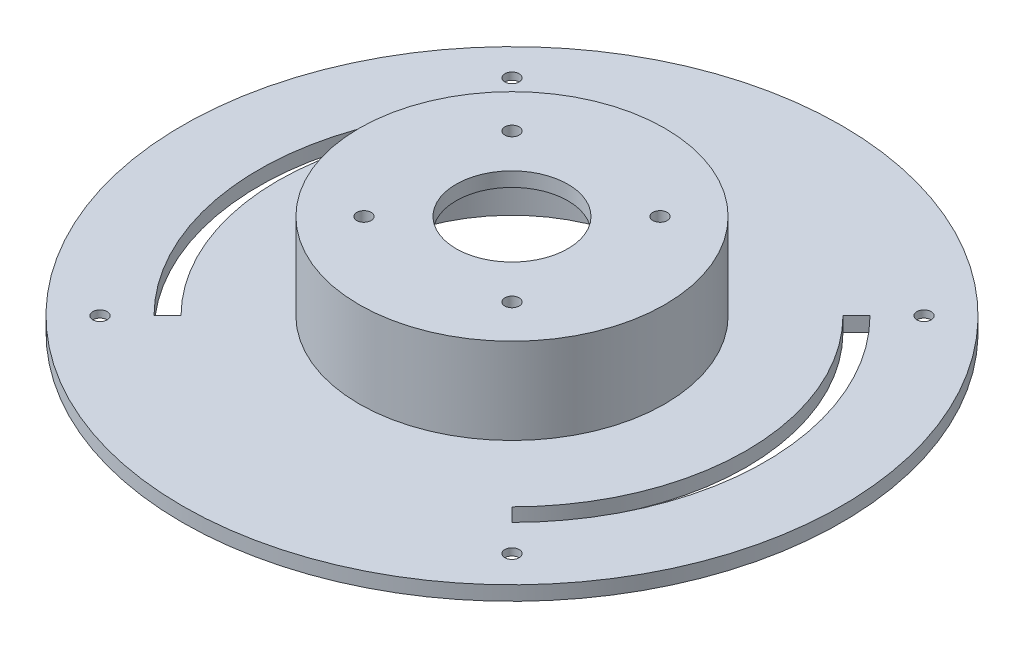
ISO-10303-21;
HEADER;
FILE_DESCRIPTION(('STEP AP214'),'2;1');
FILE_NAME('part.step','',(''),(''),'','','');
FILE_SCHEMA(('AUTOMOTIVE_DESIGN { 1 0 10303 214 1 1 1 1 }'));
ENDSEC;
DATA;
#1=APPLICATION_CONTEXT('core data for automotive mechanical design processes');
#2=APPLICATION_PROTOCOL_DEFINITION('international standard','automotive_design',2000,#1);
#3=PRODUCT_CONTEXT('',#1,'mechanical');
#4=PRODUCT('Part','Part','',(#3));
#5=PRODUCT_RELATED_PRODUCT_CATEGORY('part','',(#4));
#6=PRODUCT_DEFINITION_FORMATION('','',#4);
#7=PRODUCT_DEFINITION_CONTEXT('part definition',#1,'design');
#8=PRODUCT_DEFINITION('design','',#6,#7);
#9=PRODUCT_DEFINITION_SHAPE('','',#8);
#10=(LENGTH_UNIT() NAMED_UNIT(*) SI_UNIT(.MILLI.,.METRE.));
#11=(NAMED_UNIT(*) PLANE_ANGLE_UNIT() SI_UNIT($,.RADIAN.));
#12=(NAMED_UNIT(*) SI_UNIT($,.STERADIAN.) SOLID_ANGLE_UNIT());
#13=UNCERTAINTY_MEASURE_WITH_UNIT(LENGTH_MEASURE(1.E-05),#10,'distance_accuracy_value','');
#14=(GEOMETRIC_REPRESENTATION_CONTEXT(3) GLOBAL_UNCERTAINTY_ASSIGNED_CONTEXT((#13)) GLOBAL_UNIT_ASSIGNED_CONTEXT((#10,
#11,#12)) REPRESENTATION_CONTEXT('',''));
#15=CARTESIAN_POINT('',(0.,0.,0.));
#16=DIRECTION('',(0.,0.,1.));
#17=DIRECTION('',(1.,0.,0.));
#18=AXIS2_PLACEMENT_3D('',#15,#16,#17);
#19=CARTESIAN_POINT('',(-43.1335136523793,0.,43.1335136523795));
#20=DIRECTION('',(0.,1.,0.));
#21=DIRECTION('',(0.,0.,1.));
#22=AXIS2_PLACEMENT_3D('',#19,#20,#21);
#23=CYLINDRICAL_SURFACE('',#22,1.5);
#24=CARTESIAN_POINT('',(-43.1335136523793,3.,43.1335136523795));
#25=DIRECTION('',(0.,1.,0.));
#26=DIRECTION('',(0.,0.,1.));
#27=AXIS2_PLACEMENT_3D('',#24,#25,#26);
#28=CIRCLE('',#27,1.5);
#29=CARTESIAN_POINT('',(-43.1335136523793,3.,44.6335136523795));
#30=VERTEX_POINT('',#29);
#31=EDGE_CURVE('E147',#30,#30,#28,.T.);
#32=ORIENTED_EDGE('',*,*,#31,.T.);
#33=EDGE_LOOP('',(#32));
#34=FACE_BOUND('',#33,.T.);
#35=CARTESIAN_POINT('',(-43.1335136523793,1.5,43.1335136523795));
#36=DIRECTION('',(0.,-1.,0.));
#37=DIRECTION('',(0.,0.,-1.));
#38=AXIS2_PLACEMENT_3D('',#35,#36,#37);
#39=CIRCLE('',#38,1.5);
#40=CARTESIAN_POINT('',(-43.1335136523793,1.5,41.6335136523795));
#41=VERTEX_POINT('',#40);
#42=EDGE_CURVE('E230',#41,#41,#39,.F.);
#43=ORIENTED_EDGE('',*,*,#42,.F.);
#44=EDGE_LOOP('',(#43));
#45=FACE_BOUND('',#44,.T.);
#46=ADVANCED_FACE('F32',(#34,#45),#23,.F.);
#47=CARTESIAN_POINT('',(43.1335136523793,0.,-43.1335136523795));
#48=DIRECTION('',(0.,1.,0.));
#49=DIRECTION('',(0.,0.,1.));
#50=AXIS2_PLACEMENT_3D('',#47,#48,#49);
#51=CYLINDRICAL_SURFACE('',#50,1.5);
#52=CARTESIAN_POINT('',(43.1335136523793,3.,-43.1335136523795));
#53=DIRECTION('',(0.,1.,0.));
#54=DIRECTION('',(0.,0.,1.));
#55=AXIS2_PLACEMENT_3D('',#52,#53,#54);
#56=CIRCLE('',#55,1.5);
#57=CARTESIAN_POINT('',(43.1335136523793,3.,-41.6335136523795));
#58=VERTEX_POINT('',#57);
#59=EDGE_CURVE('E133',#58,#58,#56,.T.);
#60=ORIENTED_EDGE('',*,*,#59,.T.);
#61=EDGE_LOOP('',(#60));
#62=FACE_BOUND('',#61,.T.);
#63=CARTESIAN_POINT('',(43.1335136523793,1.5,-43.1335136523795));
#64=DIRECTION('',(0.,-1.,0.));
#65=DIRECTION('',(0.,0.,-1.));
#66=AXIS2_PLACEMENT_3D('',#63,#64,#65);
#67=CIRCLE('',#66,1.5);
#68=CARTESIAN_POINT('',(43.1335136523793,1.5,-44.6335136523795));
#69=VERTEX_POINT('',#68);
#70=EDGE_CURVE('E224',#69,#69,#67,.F.);
#71=ORIENTED_EDGE('',*,*,#70,.F.);
#72=EDGE_LOOP('',(#71));
#73=FACE_BOUND('',#72,.T.);
#74=ADVANCED_FACE('F271',(#62,#73),#51,.F.);
#75=CARTESIAN_POINT('',(0.,0.,0.));
#76=DIRECTION('',(0.,1.,0.));
#77=DIRECTION('',(0.,0.,1.));
#78=AXIS2_PLACEMENT_3D('',#75,#76,#77);
#79=CYLINDRICAL_SURFACE('',#78,11.7);
#80=CARTESIAN_POINT('',(0.,21.,0.));
#81=DIRECTION('',(0.,1.,0.));
#82=DIRECTION('',(0.,0.,1.));
#83=AXIS2_PLACEMENT_3D('',#80,#81,#82);
#84=CIRCLE('',#83,11.7);
#85=CARTESIAN_POINT('',(0.,21.,11.7));
#86=VERTEX_POINT('',#85);
#87=EDGE_CURVE('E203',#86,#86,#84,.T.);
#88=ORIENTED_EDGE('',*,*,#87,.T.);
#89=EDGE_LOOP('',(#88));
#90=FACE_BOUND('',#89,.T.);
#91=CARTESIAN_POINT('',(0.,18.,0.));
#92=DIRECTION('',(0.,-1.,0.));
#93=DIRECTION('',(0.,0.,-1.));
#94=AXIS2_PLACEMENT_3D('',#91,#92,#93);
#95=CIRCLE('',#94,11.7);
#96=CARTESIAN_POINT('',(0.,18.,-11.7));
#97=VERTEX_POINT('',#96);
#98=EDGE_CURVE('E196',#97,#97,#95,.F.);
#99=ORIENTED_EDGE('',*,*,#98,.F.);
#100=EDGE_LOOP('',(#99));
#101=FACE_BOUND('',#100,.T.);
#102=ADVANCED_FACE('F277',(#90,#101),#79,.F.);
#103=CARTESIAN_POINT('',(15.5,0.,-15.5));
#104=DIRECTION('',(0.,1.,0.));
#105=DIRECTION('',(0.,0.,1.));
#106=AXIS2_PLACEMENT_3D('',#103,#104,#105);
#107=CYLINDRICAL_SURFACE('',#106,1.5);
#108=CARTESIAN_POINT('',(15.5,21.,-15.5));
#109=DIRECTION('',(0.,1.,0.));
#110=DIRECTION('',(0.,0.,1.));
#111=AXIS2_PLACEMENT_3D('',#108,#109,#110);
#112=CIRCLE('',#111,1.5);
#113=CARTESIAN_POINT('',(15.5,21.,-14.));
#114=VERTEX_POINT('',#113);
#115=EDGE_CURVE('E200',#114,#114,#112,.T.);
#116=ORIENTED_EDGE('',*,*,#115,.T.);
#117=EDGE_LOOP('',(#116));
#118=FACE_BOUND('',#117,.T.);
#119=CARTESIAN_POINT('',(15.5,18.,-15.5));
#120=DIRECTION('',(0.,-1.,0.));
#121=DIRECTION('',(0.,0.,-1.));
#122=AXIS2_PLACEMENT_3D('',#119,#120,#121);
#123=CIRCLE('',#122,1.5);
#124=CARTESIAN_POINT('',(15.5,18.,-17.));
#125=VERTEX_POINT('',#124);
#126=EDGE_CURVE('E193',#125,#125,#123,.F.);
#127=ORIENTED_EDGE('',*,*,#126,.F.);
#128=EDGE_LOOP('',(#127));
#129=FACE_BOUND('',#128,.T.);
#130=ADVANCED_FACE('F307',(#118,#129),#107,.F.);
#131=CARTESIAN_POINT('',(-15.5,0.,-15.5));
#132=DIRECTION('',(0.,1.,0.));
#133=DIRECTION('',(0.,0.,1.));
#134=AXIS2_PLACEMENT_3D('',#131,#132,#133);
#135=CYLINDRICAL_SURFACE('',#134,1.5);
#136=CARTESIAN_POINT('',(-15.5,21.,-15.5));
#137=DIRECTION('',(0.,1.,0.));
#138=DIRECTION('',(0.,0.,-1.));
#139=AXIS2_PLACEMENT_3D('',#136,#137,#138);
#140=CIRCLE('',#139,1.5);
#141=CARTESIAN_POINT('',(-15.5,21.,-17.));
#142=VERTEX_POINT('',#141);
#143=EDGE_CURVE('E204',#142,#142,#140,.T.);
#144=ORIENTED_EDGE('',*,*,#143,.T.);
#145=EDGE_LOOP('',(#144));
#146=FACE_BOUND('',#145,.T.);
#147=CARTESIAN_POINT('',(-15.5,18.,-15.5));
#148=DIRECTION('',(0.,-1.,0.));
#149=DIRECTION('',(0.,0.,-1.));
#150=AXIS2_PLACEMENT_3D('',#147,#148,#149);
#151=CIRCLE('',#150,1.5);
#152=CARTESIAN_POINT('',(-15.5,18.,-17.));
#153=VERTEX_POINT('',#152);
#154=EDGE_CURVE('E190',#153,#153,#151,.F.);
#155=ORIENTED_EDGE('',*,*,#154,.F.);
#156=EDGE_LOOP('',(#155));
#157=FACE_BOUND('',#156,.T.);
#158=ADVANCED_FACE('F310',(#146,#157),#135,.F.);
#159=CARTESIAN_POINT('',(15.5,0.,15.5));
#160=DIRECTION('',(0.,1.,0.));
#161=DIRECTION('',(0.,0.,1.));
#162=AXIS2_PLACEMENT_3D('',#159,#160,#161);
#163=CYLINDRICAL_SURFACE('',#162,1.5);
#164=CARTESIAN_POINT('',(15.5,21.,15.5));
#165=DIRECTION('',(0.,1.,0.));
#166=DIRECTION('',(0.,0.,-1.));
#167=AXIS2_PLACEMENT_3D('',#164,#165,#166);
#168=CIRCLE('',#167,1.5);
#169=CARTESIAN_POINT('',(15.5,21.,14.));
#170=VERTEX_POINT('',#169);
#171=EDGE_CURVE('E207',#170,#170,#168,.T.);
#172=ORIENTED_EDGE('',*,*,#171,.T.);
#173=EDGE_LOOP('',(#172));
#174=FACE_BOUND('',#173,.T.);
#175=CARTESIAN_POINT('',(15.5,18.,15.5));
#176=DIRECTION('',(0.,-1.,0.));
#177=DIRECTION('',(0.,0.,-1.));
#178=AXIS2_PLACEMENT_3D('',#175,#176,#177);
#179=CIRCLE('',#178,1.5);
#180=CARTESIAN_POINT('',(15.5,18.,14.));
#181=VERTEX_POINT('',#180);
#182=EDGE_CURVE('E187',#181,#181,#179,.F.);
#183=ORIENTED_EDGE('',*,*,#182,.F.);
#184=EDGE_LOOP('',(#183));
#185=FACE_BOUND('',#184,.T.);
#186=ADVANCED_FACE('F314',(#174,#185),#163,.F.);
#187=CARTESIAN_POINT('',(-15.5,0.,15.5));
#188=DIRECTION('',(0.,1.,0.));
#189=DIRECTION('',(0.,0.,1.));
#190=AXIS2_PLACEMENT_3D('',#187,#188,#189);
#191=CYLINDRICAL_SURFACE('',#190,1.5);
#192=CARTESIAN_POINT('',(-15.5,21.,15.5));
#193=DIRECTION('',(0.,1.,0.));
#194=DIRECTION('',(0.,0.,1.));
#195=AXIS2_PLACEMENT_3D('',#192,#193,#194);
#196=CIRCLE('',#195,1.5);
#197=CARTESIAN_POINT('',(-15.5,21.,17.));
#198=VERTEX_POINT('',#197);
#199=EDGE_CURVE('E199',#198,#198,#196,.T.);
#200=ORIENTED_EDGE('',*,*,#199,.T.);
#201=EDGE_LOOP('',(#200));
#202=FACE_BOUND('',#201,.T.);
#203=CARTESIAN_POINT('',(-15.5,18.,15.5));
#204=DIRECTION('',(0.,-1.,0.));
#205=DIRECTION('',(0.,0.,-1.));
#206=AXIS2_PLACEMENT_3D('',#203,#204,#205);
#207=CIRCLE('',#206,1.5);
#208=CARTESIAN_POINT('',(-15.5,18.,14.));
#209=VERTEX_POINT('',#208);
#210=EDGE_CURVE('E184',#209,#209,#207,.F.);
#211=ORIENTED_EDGE('',*,*,#210,.F.);
#212=EDGE_LOOP('',(#211));
#213=FACE_BOUND('',#212,.T.);
#214=ADVANCED_FACE('F256',(#202,#213),#191,.F.);
#215=CARTESIAN_POINT('',(0.,3.,0.));
#216=DIRECTION('',(0.,-1.,0.));
#217=DIRECTION('',(0.,0.,-1.));
#218=AXIS2_PLACEMENT_3D('',#215,#216,#217);
#219=CYLINDRICAL_SURFACE('',#218,69.);
#220=CARTESIAN_POINT('',(0.,3.,0.));
#221=DIRECTION('',(0.,1.,0.));
#222=DIRECTION('',(0.,0.,1.));
#223=AXIS2_PLACEMENT_3D('',#220,#221,#222);
#224=CIRCLE('',#223,69.);
#225=CARTESIAN_POINT('',(0.,3.,69.));
#226=VERTEX_POINT('',#225);
#227=EDGE_CURVE('E41',#226,#226,#224,.T.);
#228=ORIENTED_EDGE('',*,*,#227,.F.);
#229=EDGE_LOOP('',(#228));
#230=FACE_BOUND('',#229,.T.);
#231=CARTESIAN_POINT('',(0.,0.,0.));
#232=DIRECTION('',(0.,1.,0.));
#233=DIRECTION('',(0.,0.,1.));
#234=AXIS2_PLACEMENT_3D('',#231,#232,#233);
#235=CIRCLE('',#234,69.);
#236=CARTESIAN_POINT('',(0.,0.,69.));
#237=VERTEX_POINT('',#236);
#238=EDGE_CURVE('E216',#237,#237,#235,.T.);
#239=ORIENTED_EDGE('',*,*,#238,.T.);
#240=EDGE_LOOP('',(#239));
#241=FACE_BOUND('',#240,.T.);
#242=ADVANCED_FACE('F34',(#230,#241),#219,.T.);
#243=CARTESIAN_POINT('',(0.,3.,0.));
#244=DIRECTION('',(0.,1.,0.));
#245=DIRECTION('',(0.,0.,1.));
#246=AXIS2_PLACEMENT_3D('',#243,#244,#245);
#247=PLANE('',#246);
#248=CARTESIAN_POINT('',(3.67761376907083E-13,3.,-3.81639164714898E-13));
#249=DIRECTION('',(0.,1.,0.));
#250=DIRECTION('',(0.,0.,1.));
#251=AXIS2_PLACEMENT_3D('',#248,#249,#250);
#252=CIRCLE('',#251,53.0000000000002);
#253=CARTESIAN_POINT('',(-37.4766594028869,3.,-37.4766594028871));
#254=VERTEX_POINT('',#253);
#255=CARTESIAN_POINT('',(-37.4766594028875,3.,37.4766594028865));
#256=VERTEX_POINT('',#255);
#257=EDGE_CURVE('E49',#254,#256,#252,.T.);
#258=ORIENTED_EDGE('',*,*,#257,.F.);
#259=DIRECTION('',(-0.707106781186547,0.,-0.707106781186548));
#260=VECTOR('',#259,1.);
#261=CARTESIAN_POINT('',(-34.6482322781407,3.,-34.6482322781409));
#262=LINE('',#261,#260);
#263=CARTESIAN_POINT('',(-34.6482322781407,3.,-34.6482322781409));
#264=VERTEX_POINT('',#263);
#265=EDGE_CURVE('E120',#264,#254,#262,.T.);
#266=ORIENTED_EDGE('',*,*,#265,.F.);
#267=CARTESIAN_POINT('',(0.,3.,0.));
#268=DIRECTION('',(0.,-1.,0.));
#269=DIRECTION('',(0.,0.,1.));
#270=AXIS2_PLACEMENT_3D('',#267,#268,#269);
#271=CIRCLE('',#270,49.);
#272=CARTESIAN_POINT('',(-34.6482322781412,3.,34.6482322781404));
#273=VERTEX_POINT('',#272);
#274=EDGE_CURVE('E123',#273,#264,#271,.T.);
#275=ORIENTED_EDGE('',*,*,#274,.F.);
#276=DIRECTION('',(0.707106781186556,0.,-0.707106781186539));
#277=VECTOR('',#276,1.);
#278=CARTESIAN_POINT('',(-37.4766594028875,3.,37.4766594028865));
#279=LINE('',#278,#277);
#280=EDGE_CURVE('E132',#256,#273,#279,.T.);
#281=ORIENTED_EDGE('',*,*,#280,.F.);
#282=EDGE_LOOP('',(#258,#266,#275,#281));
#283=FACE_BOUND('',#282,.T.);
#284=ORIENTED_EDGE('',*,*,#59,.F.);
#285=EDGE_LOOP('',(#284));
#286=FACE_BOUND('',#285,.T.);
#287=CARTESIAN_POINT('',(43.1335136523793,3.,43.1335136523795));
#288=DIRECTION('',(0.,1.,0.));
#289=DIRECTION('',(0.,0.,-1.));
#290=AXIS2_PLACEMENT_3D('',#287,#288,#289);
#291=CIRCLE('',#290,1.5);
#292=CARTESIAN_POINT('',(43.1335136523793,3.,41.6335136523795));
#293=VERTEX_POINT('',#292);
#294=EDGE_CURVE('E144',#293,#293,#291,.T.);
#295=ORIENTED_EDGE('',*,*,#294,.F.);
#296=EDGE_LOOP('',(#295));
#297=FACE_BOUND('',#296,.T.);
#298=ORIENTED_EDGE('',*,*,#31,.F.);
#299=EDGE_LOOP('',(#298));
#300=FACE_BOUND('',#299,.T.);
#301=CARTESIAN_POINT('',(-43.1335136523793,3.,-43.1335136523795));
#302=DIRECTION('',(0.,1.,0.));
#303=DIRECTION('',(0.,0.,-1.));
#304=AXIS2_PLACEMENT_3D('',#301,#302,#303);
#305=CIRCLE('',#304,1.5);
#306=CARTESIAN_POINT('',(-43.1335136523793,3.,-44.6335136523795));
#307=VERTEX_POINT('',#306);
#308=EDGE_CURVE('E126',#307,#307,#305,.T.);
#309=ORIENTED_EDGE('',*,*,#308,.F.);
#310=EDGE_LOOP('',(#309));
#311=FACE_BOUND('',#310,.T.);
#312=CARTESIAN_POINT('',(0.,3.,0.));
#313=DIRECTION('',(0.,-1.,0.));
#314=DIRECTION('',(0.,0.,-1.));
#315=AXIS2_PLACEMENT_3D('',#312,#313,#314);
#316=CIRCLE('',#315,49.);
#317=CARTESIAN_POINT('',(34.6482322781407,3.,-34.6482322781409));
#318=VERTEX_POINT('',#317);
#319=CARTESIAN_POINT('',(34.6482322781412,3.,34.6482322781404));
#320=VERTEX_POINT('',#319);
#321=EDGE_CURVE('E57',#318,#320,#316,.T.);
#322=ORIENTED_EDGE('',*,*,#321,.F.);
#323=DIRECTION('',(-0.707106781186547,0.,0.707106781186548));
#324=VECTOR('',#323,1.);
#325=CARTESIAN_POINT('',(34.6482322781407,3.,-34.6482322781409));
#326=LINE('',#325,#324);
#327=CARTESIAN_POINT('',(37.4766594028869,3.,-37.4766594028871));
#328=VERTEX_POINT('',#327);
#329=EDGE_CURVE('E154',#328,#318,#326,.T.);
#330=ORIENTED_EDGE('',*,*,#329,.F.);
#331=CARTESIAN_POINT('',(3.67761376907083E-13,3.,-3.81639164714898E-13));
#332=DIRECTION('',(0.,1.,0.));
#333=DIRECTION('',(0.,0.,-1.));
#334=AXIS2_PLACEMENT_3D('',#331,#332,#333);
#335=CIRCLE('',#334,52.9999999999997);
#336=CARTESIAN_POINT('',(37.4766594028873,3.,37.4766594028864));
#337=VERTEX_POINT('',#336);
#338=EDGE_CURVE('E168',#337,#328,#335,.T.);
#339=ORIENTED_EDGE('',*,*,#338,.F.);
#340=DIRECTION('',(0.707106781186556,0.,0.707106781186539));
#341=VECTOR('',#340,1.);
#342=CARTESIAN_POINT('',(37.4766594028875,3.,37.4766594028865));
#343=LINE('',#342,#341);
#344=EDGE_CURVE('E165',#320,#337,#343,.T.);
#345=ORIENTED_EDGE('',*,*,#344,.F.);
#346=EDGE_LOOP('',(#322,#330,#339,#345));
#347=FACE_BOUND('',#346,.T.);
#348=CARTESIAN_POINT('',(0.,3.,0.));
#349=DIRECTION('',(0.,1.,0.));
#350=DIRECTION('',(0.,0.,1.));
#351=AXIS2_PLACEMENT_3D('',#348,#349,#350);
#352=CIRCLE('',#351,32.);
#353=CARTESIAN_POINT('',(0.,3.,32.));
#354=VERTEX_POINT('',#353);
#355=EDGE_CURVE('E11',#354,#354,#352,.T.);
#356=ORIENTED_EDGE('',*,*,#355,.F.);
#357=EDGE_LOOP('',(#356));
#358=FACE_BOUND('',#357,.T.);
#359=ORIENTED_EDGE('',*,*,#227,.T.);
#360=EDGE_LOOP('',(#359));
#361=FACE_BOUND('',#360,.T.);
#362=ADVANCED_FACE('F242',(#283,#286,#297,#300,#311,#347,#358,#361),#247,.T.);
#363=CARTESIAN_POINT('',(0.,0.,0.));
#364=DIRECTION('',(0.,1.,0.));
#365=DIRECTION('',(0.,0.,1.));
#366=AXIS2_PLACEMENT_3D('',#363,#364,#365);
#367=PLANE('',#366);
#368=CARTESIAN_POINT('',(-43.1335136523793,0.,-43.1335136523795));
#369=DIRECTION('',(0.,-1.,0.));
#370=DIRECTION('',(0.,0.,1.));
#371=AXIS2_PLACEMENT_3D('',#368,#369,#370);
#372=CIRCLE('',#371,4.05);
#373=CARTESIAN_POINT('',(-43.1335136523793,0.,-39.0835136523795));
#374=VERTEX_POINT('',#373);
#375=EDGE_CURVE('E595',#374,#374,#372,.T.);
#376=ORIENTED_EDGE('',*,*,#375,.F.);
#377=EDGE_LOOP('',(#376));
#378=FACE_BOUND('',#377,.T.);
#379=CARTESIAN_POINT('',(43.1335136523793,0.,-43.1335136523795));
#380=DIRECTION('',(0.,-1.,0.));
#381=DIRECTION('',(0.,0.,-1.));
#382=AXIS2_PLACEMENT_3D('',#379,#380,#381);
#383=CIRCLE('',#382,4.05);
#384=CARTESIAN_POINT('',(43.1335136523793,0.,-47.1835136523795));
#385=VERTEX_POINT('',#384);
#386=EDGE_CURVE('E597',#385,#385,#383,.T.);
#387=ORIENTED_EDGE('',*,*,#386,.F.);
#388=EDGE_LOOP('',(#387));
#389=FACE_BOUND('',#388,.T.);
#390=CARTESIAN_POINT('',(43.1335136523793,0.,43.1335136523795));
#391=DIRECTION('',(0.,-1.,0.));
#392=DIRECTION('',(0.,0.,1.));
#393=AXIS2_PLACEMENT_3D('',#390,#391,#392);
#394=CIRCLE('',#393,4.05);
#395=CARTESIAN_POINT('',(43.1335136523793,0.,47.1835136523795));
#396=VERTEX_POINT('',#395);
#397=EDGE_CURVE('E608',#396,#396,#394,.T.);
#398=ORIENTED_EDGE('',*,*,#397,.F.);
#399=EDGE_LOOP('',(#398));
#400=FACE_BOUND('',#399,.T.);
#401=CARTESIAN_POINT('',(-43.1335136523793,0.,43.1335136523795));
#402=DIRECTION('',(0.,-1.,0.));
#403=DIRECTION('',(0.,0.,-1.));
#404=AXIS2_PLACEMENT_3D('',#401,#402,#403);
#405=CIRCLE('',#404,4.05);
#406=CARTESIAN_POINT('',(-43.1335136523793,0.,39.0835136523795));
#407=VERTEX_POINT('',#406);
#408=EDGE_CURVE('E602',#407,#407,#405,.T.);
#409=ORIENTED_EDGE('',*,*,#408,.F.);
#410=EDGE_LOOP('',(#409));
#411=FACE_BOUND('',#410,.T.);
#412=DIRECTION('',(-0.707106781186547,0.,-0.707106781186548));
#413=VECTOR('',#412,1.);
#414=CARTESIAN_POINT('',(-34.6482322781407,0.,-34.6482322781409));
#415=LINE('',#414,#413);
#416=CARTESIAN_POINT('',(-34.6482322781407,0.,-34.6482322781409));
#417=VERTEX_POINT('',#416);
#418=CARTESIAN_POINT('',(-37.4766594028869,0.,-37.4766594028871));
#419=VERTEX_POINT('',#418);
#420=EDGE_CURVE('E107',#417,#419,#415,.T.);
#421=ORIENTED_EDGE('',*,*,#420,.T.);
#422=CARTESIAN_POINT('',(3.67761376907083E-13,0.,-3.81639164714898E-13));
#423=DIRECTION('',(0.,1.,0.));
#424=DIRECTION('',(0.,0.,1.));
#425=AXIS2_PLACEMENT_3D('',#422,#423,#424);
#426=CIRCLE('',#425,53.0000000000002);
#427=CARTESIAN_POINT('',(-37.4766594028875,0.,37.4766594028865));
#428=VERTEX_POINT('',#427);
#429=EDGE_CURVE('E101',#419,#428,#426,.T.);
#430=ORIENTED_EDGE('',*,*,#429,.T.);
#431=DIRECTION('',(0.707106781186556,0.,-0.707106781186539));
#432=VECTOR('',#431,1.);
#433=CARTESIAN_POINT('',(-37.4766594028875,0.,37.4766594028865));
#434=LINE('',#433,#432);
#435=CARTESIAN_POINT('',(-34.6482322781412,0.,34.6482322781404));
#436=VERTEX_POINT('',#435);
#437=EDGE_CURVE('E111',#428,#436,#434,.T.);
#438=ORIENTED_EDGE('',*,*,#437,.T.);
#439=CARTESIAN_POINT('',(0.,0.,0.));
#440=DIRECTION('',(0.,-1.,0.));
#441=DIRECTION('',(0.,0.,1.));
#442=AXIS2_PLACEMENT_3D('',#439,#440,#441);
#443=CIRCLE('',#442,49.);
#444=EDGE_CURVE('E115',#436,#417,#443,.T.);
#445=ORIENTED_EDGE('',*,*,#444,.T.);
#446=EDGE_LOOP('',(#421,#430,#438,#445));
#447=FACE_BOUND('',#446,.T.);
#448=DIRECTION('',(-0.707106781186547,0.,0.707106781186548));
#449=VECTOR('',#448,1.);
#450=CARTESIAN_POINT('',(34.6482322781407,0.,-34.6482322781409));
#451=LINE('',#450,#449);
#452=CARTESIAN_POINT('',(37.4766594028869,0.,-37.4766594028871));
#453=VERTEX_POINT('',#452);
#454=CARTESIAN_POINT('',(34.6482322781407,0.,-34.6482322781409));
#455=VERTEX_POINT('',#454);
#456=EDGE_CURVE('E160',#453,#455,#451,.T.);
#457=ORIENTED_EDGE('',*,*,#456,.T.);
#458=CARTESIAN_POINT('',(0.,0.,0.));
#459=DIRECTION('',(0.,-1.,0.));
#460=DIRECTION('',(0.,0.,-1.));
#461=AXIS2_PLACEMENT_3D('',#458,#459,#460);
#462=CIRCLE('',#461,49.);
#463=CARTESIAN_POINT('',(34.6482322781412,0.,34.6482322781404));
#464=VERTEX_POINT('',#463);
#465=EDGE_CURVE('E150',#455,#464,#462,.T.);
#466=ORIENTED_EDGE('',*,*,#465,.T.);
#467=DIRECTION('',(0.707106781186556,0.,0.707106781186539));
#468=VECTOR('',#467,1.);
#469=CARTESIAN_POINT('',(37.4766594028875,0.,37.4766594028865));
#470=LINE('',#469,#468);
#471=CARTESIAN_POINT('',(37.4766594028873,0.,37.4766594028864));
#472=VERTEX_POINT('',#471);
#473=EDGE_CURVE('E153',#464,#472,#470,.T.);
#474=ORIENTED_EDGE('',*,*,#473,.T.);
#475=CARTESIAN_POINT('',(3.67761376907083E-13,0.,-3.81639164714898E-13));
#476=DIRECTION('',(0.,1.,0.));
#477=DIRECTION('',(0.,0.,-1.));
#478=AXIS2_PLACEMENT_3D('',#475,#476,#477);
#479=CIRCLE('',#478,52.9999999999997);
#480=EDGE_CURVE('E157',#472,#453,#479,.T.);
#481=ORIENTED_EDGE('',*,*,#480,.T.);
#482=EDGE_LOOP('',(#457,#466,#474,#481));
#483=FACE_BOUND('',#482,.T.);
#484=CARTESIAN_POINT('',(0.,0.,0.));
#485=DIRECTION('',(0.,-1.,0.));
#486=DIRECTION('',(0.,0.,-1.));
#487=AXIS2_PLACEMENT_3D('',#484,#485,#486);
#488=CIRCLE('',#487,30.);
#489=CARTESIAN_POINT('',(0.,0.,-30.));
#490=VERTEX_POINT('',#489);
#491=EDGE_CURVE('E175',#490,#490,#488,.T.);
#492=ORIENTED_EDGE('',*,*,#491,.F.);
#493=EDGE_LOOP('',(#492));
#494=FACE_BOUND('',#493,.T.);
#495=ORIENTED_EDGE('',*,*,#238,.F.);
#496=EDGE_LOOP('',(#495));
#497=FACE_BOUND('',#496,.T.);
#498=ADVANCED_FACE('F117',(#378,#389,#400,#411,#447,#483,#494,#497),#367,.F.);
#499=CARTESIAN_POINT('',(0.,21.,0.));
#500=DIRECTION('',(0.,-1.,0.));
#501=DIRECTION('',(0.,0.,-1.));
#502=AXIS2_PLACEMENT_3D('',#499,#500,#501);
#503=CYLINDRICAL_SURFACE('',#502,32.);
#504=CARTESIAN_POINT('',(0.,21.,0.));
#505=DIRECTION('',(0.,1.,0.));
#506=DIRECTION('',(0.,0.,1.));
#507=AXIS2_PLACEMENT_3D('',#504,#505,#506);
#508=CIRCLE('',#507,32.);
#509=CARTESIAN_POINT('',(0.,21.,32.));
#510=VERTEX_POINT('',#509);
#511=EDGE_CURVE('E214',#510,#510,#508,.T.);
#512=ORIENTED_EDGE('',*,*,#511,.F.);
#513=EDGE_LOOP('',(#512));
#514=FACE_BOUND('',#513,.T.);
#515=ORIENTED_EDGE('',*,*,#355,.T.);
#516=EDGE_LOOP('',(#515));
#517=FACE_BOUND('',#516,.T.);
#518=ADVANCED_FACE('F260',(#514,#517),#503,.T.);
#519=CARTESIAN_POINT('',(0.,21.,0.));
#520=DIRECTION('',(0.,1.,0.));
#521=DIRECTION('',(0.,0.,1.));
#522=AXIS2_PLACEMENT_3D('',#519,#520,#521);
#523=PLANE('',#522);
#524=ORIENTED_EDGE('',*,*,#199,.F.);
#525=EDGE_LOOP('',(#524));
#526=FACE_BOUND('',#525,.T.);
#527=ORIENTED_EDGE('',*,*,#171,.F.);
#528=EDGE_LOOP('',(#527));
#529=FACE_BOUND('',#528,.T.);
#530=ORIENTED_EDGE('',*,*,#143,.F.);
#531=EDGE_LOOP('',(#530));
#532=FACE_BOUND('',#531,.T.);
#533=ORIENTED_EDGE('',*,*,#115,.F.);
#534=EDGE_LOOP('',(#533));
#535=FACE_BOUND('',#534,.T.);
#536=ORIENTED_EDGE('',*,*,#87,.F.);
#537=EDGE_LOOP('',(#536));
#538=FACE_BOUND('',#537,.T.);
#539=ORIENTED_EDGE('',*,*,#511,.T.);
#540=EDGE_LOOP('',(#539));
#541=FACE_BOUND('',#540,.T.);
#542=ADVANCED_FACE('F265',(#526,#529,#532,#535,#538,#541),#523,.T.);
#543=CARTESIAN_POINT('',(0.,18.,0.));
#544=DIRECTION('',(0.,-1.,0.));
#545=DIRECTION('',(0.,0.,-1.));
#546=AXIS2_PLACEMENT_3D('',#543,#544,#545);
#547=PLANE('',#546);
#548=CARTESIAN_POINT('',(0.,18.,0.));
#549=DIRECTION('',(0.,-1.,0.));
#550=DIRECTION('',(0.,0.,-1.));
#551=AXIS2_PLACEMENT_3D('',#548,#549,#550);
#552=CIRCLE('',#551,30.);
#553=CARTESIAN_POINT('',(0.,18.,-30.));
#554=VERTEX_POINT('',#553);
#555=EDGE_CURVE('E181',#554,#554,#552,.T.);
#556=ORIENTED_EDGE('',*,*,#555,.T.);
#557=EDGE_LOOP('',(#556));
#558=FACE_BOUND('',#557,.T.);
#559=ORIENTED_EDGE('',*,*,#210,.T.);
#560=EDGE_LOOP('',(#559));
#561=FACE_BOUND('',#560,.T.);
#562=ORIENTED_EDGE('',*,*,#182,.T.);
#563=EDGE_LOOP('',(#562));
#564=FACE_BOUND('',#563,.T.);
#565=ORIENTED_EDGE('',*,*,#154,.T.);
#566=EDGE_LOOP('',(#565));
#567=FACE_BOUND('',#566,.T.);
#568=ORIENTED_EDGE('',*,*,#126,.T.);
#569=EDGE_LOOP('',(#568));
#570=FACE_BOUND('',#569,.T.);
#571=ORIENTED_EDGE('',*,*,#98,.T.);
#572=EDGE_LOOP('',(#571));
#573=FACE_BOUND('',#572,.T.);
#574=ADVANCED_FACE('F300',(#558,#561,#564,#567,#570,#573),#547,.T.);
#575=CARTESIAN_POINT('',(0.,18.,0.));
#576=DIRECTION('',(0.,-1.,0.));
#577=DIRECTION('',(0.,0.,-1.));
#578=AXIS2_PLACEMENT_3D('',#575,#576,#577);
#579=CYLINDRICAL_SURFACE('',#578,30.);
#580=ORIENTED_EDGE('',*,*,#555,.F.);
#581=EDGE_LOOP('',(#580));
#582=FACE_BOUND('',#581,.T.);
#583=ORIENTED_EDGE('',*,*,#491,.T.);
#584=EDGE_LOOP('',(#583));
#585=FACE_BOUND('',#584,.T.);
#586=ADVANCED_FACE('F299',(#582,#585),#579,.F.);
#587=CARTESIAN_POINT('',(0.,0.,0.));
#588=DIRECTION('',(0.,1.,0.));
#589=DIRECTION('',(0.,0.,1.));
#590=AXIS2_PLACEMENT_3D('',#587,#588,#589);
#591=CYLINDRICAL_SURFACE('',#590,49.);
#592=ORIENTED_EDGE('',*,*,#321,.T.);
#593=DIRECTION('',(0.,1.,0.));
#594=VECTOR('',#593,1.);
#595=CARTESIAN_POINT('',(34.6482322781412,0.,34.6482322781404));
#596=LINE('',#595,#594);
#597=EDGE_CURVE('E163',#464,#320,#596,.T.);
#598=ORIENTED_EDGE('',*,*,#597,.F.);
#599=ORIENTED_EDGE('',*,*,#465,.F.);
#600=DIRECTION('',(0.,1.,0.));
#601=VECTOR('',#600,1.);
#602=CARTESIAN_POINT('',(34.6482322781407,0.,-34.6482322781409));
#603=LINE('',#602,#601);
#604=EDGE_CURVE('E173',#455,#318,#603,.T.);
#605=ORIENTED_EDGE('',*,*,#604,.T.);
#606=EDGE_LOOP('',(#592,#598,#599,#605));
#607=FACE_BOUND('',#606,.T.);
#608=ADVANCED_FACE('F288',(#607),#591,.T.);
#609=CARTESIAN_POINT('',(34.6482322781407,0.,-34.6482322781409));
#610=DIRECTION('',(-0.707106781186548,0.,-0.707106781186547));
#611=DIRECTION('',(-0.707106781186547,0.,0.707106781186548));
#612=AXIS2_PLACEMENT_3D('',#609,#610,#611);
#613=PLANE('',#612);
#614=ORIENTED_EDGE('',*,*,#329,.T.);
#615=ORIENTED_EDGE('',*,*,#604,.F.);
#616=ORIENTED_EDGE('',*,*,#456,.F.);
#617=DIRECTION('',(0.,1.,0.));
#618=VECTOR('',#617,1.);
#619=CARTESIAN_POINT('',(37.4766594028869,0.,-37.4766594028871));
#620=LINE('',#619,#618);
#621=EDGE_CURVE('E176',#453,#328,#620,.T.);
#622=ORIENTED_EDGE('',*,*,#621,.T.);
#623=EDGE_LOOP('',(#614,#615,#616,#622));
#624=FACE_BOUND('',#623,.T.);
#625=ADVANCED_FACE('F284',(#624),#613,.F.);
#626=CARTESIAN_POINT('',(3.67761376907083E-13,0.,-3.81639164714898E-13));
#627=DIRECTION('',(0.,1.,0.));
#628=DIRECTION('',(0.,0.,1.));
#629=AXIS2_PLACEMENT_3D('',#626,#627,#628);
#630=CYLINDRICAL_SURFACE('',#629,52.9999999999997);
#631=ORIENTED_EDGE('',*,*,#338,.T.);
#632=ORIENTED_EDGE('',*,*,#621,.F.);
#633=ORIENTED_EDGE('',*,*,#480,.F.);
#634=DIRECTION('',(0.,1.,0.));
#635=VECTOR('',#634,1.);
#636=CARTESIAN_POINT('',(37.4766594028873,0.,37.4766594028864));
#637=LINE('',#636,#635);
#638=EDGE_CURVE('E178',#472,#337,#637,.T.);
#639=ORIENTED_EDGE('',*,*,#638,.T.);
#640=EDGE_LOOP('',(#631,#632,#633,#639));
#641=FACE_BOUND('',#640,.T.);
#642=ADVANCED_FACE('F287',(#641),#630,.F.);
#643=CARTESIAN_POINT('',(37.4766594028875,0.,37.4766594028865));
#644=DIRECTION('',(-0.707106781186539,0.,0.707106781186556));
#645=DIRECTION('',(0.707106781186556,0.,0.707106781186539));
#646=AXIS2_PLACEMENT_3D('',#643,#644,#645);
#647=PLANE('',#646);
#648=ORIENTED_EDGE('',*,*,#344,.T.);
#649=ORIENTED_EDGE('',*,*,#638,.F.);
#650=ORIENTED_EDGE('',*,*,#473,.F.);
#651=ORIENTED_EDGE('',*,*,#597,.T.);
#652=EDGE_LOOP('',(#648,#649,#650,#651));
#653=FACE_BOUND('',#652,.T.);
#654=ADVANCED_FACE('F292',(#653),#647,.F.);
#655=CARTESIAN_POINT('',(-43.1335136523793,0.,-43.1335136523795));
#656=DIRECTION('',(0.,1.,0.));
#657=DIRECTION('',(0.,0.,1.));
#658=AXIS2_PLACEMENT_3D('',#655,#656,#657);
#659=CYLINDRICAL_SURFACE('',#658,1.5);
#660=CARTESIAN_POINT('',(-43.1335136523793,1.5,-43.1335136523795));
#661=DIRECTION('',(0.,1.,0.));
#662=DIRECTION('',(0.,0.,1.));
#663=AXIS2_PLACEMENT_3D('',#660,#661,#662);
#664=CIRCLE('',#663,1.5);
#665=CARTESIAN_POINT('',(-43.1335136523793,1.5,-41.6335136523795));
#666=VERTEX_POINT('',#665);
#667=EDGE_CURVE('E36',#666,#666,#664,.F.);
#668=ORIENTED_EDGE('',*,*,#667,.T.);
#669=EDGE_LOOP('',(#668));
#670=FACE_BOUND('',#669,.T.);
#671=ORIENTED_EDGE('',*,*,#308,.T.);
#672=EDGE_LOOP('',(#671));
#673=FACE_BOUND('',#672,.T.);
#674=ADVANCED_FACE('F240',(#670,#673),#659,.F.);
#675=CARTESIAN_POINT('',(43.1335136523793,0.,43.1335136523795));
#676=DIRECTION('',(0.,1.,0.));
#677=DIRECTION('',(0.,0.,1.));
#678=AXIS2_PLACEMENT_3D('',#675,#676,#677);
#679=CYLINDRICAL_SURFACE('',#678,1.5);
#680=CARTESIAN_POINT('',(43.1335136523793,1.5,43.1335136523795));
#681=DIRECTION('',(0.,1.,0.));
#682=DIRECTION('',(0.,0.,1.));
#683=AXIS2_PLACEMENT_3D('',#680,#681,#682);
#684=CIRCLE('',#683,1.5);
#685=CARTESIAN_POINT('',(43.1335136523793,1.5,44.6335136523795));
#686=VERTEX_POINT('',#685);
#687=EDGE_CURVE('E227',#686,#686,#684,.F.);
#688=ORIENTED_EDGE('',*,*,#687,.T.);
#689=EDGE_LOOP('',(#688));
#690=FACE_BOUND('',#689,.T.);
#691=ORIENTED_EDGE('',*,*,#294,.T.);
#692=EDGE_LOOP('',(#691));
#693=FACE_BOUND('',#692,.T.);
#694=ADVANCED_FACE('F283',(#690,#693),#679,.F.);
#695=CARTESIAN_POINT('',(3.67761376907083E-13,0.,-3.81639164714898E-13));
#696=DIRECTION('',(0.,1.,0.));
#697=DIRECTION('',(0.,0.,1.));
#698=AXIS2_PLACEMENT_3D('',#695,#696,#697);
#699=CYLINDRICAL_SURFACE('',#698,53.0000000000002);
#700=ORIENTED_EDGE('',*,*,#257,.T.);
#701=DIRECTION('',(0.,1.,0.));
#702=VECTOR('',#701,1.);
#703=CARTESIAN_POINT('',(-37.4766594028875,0.,37.4766594028865));
#704=LINE('',#703,#702);
#705=EDGE_CURVE('E97',#428,#256,#704,.T.);
#706=ORIENTED_EDGE('',*,*,#705,.F.);
#707=ORIENTED_EDGE('',*,*,#429,.F.);
#708=DIRECTION('',(0.,1.,0.));
#709=VECTOR('',#708,1.);
#710=CARTESIAN_POINT('',(-37.4766594028869,0.,-37.4766594028871));
#711=LINE('',#710,#709);
#712=EDGE_CURVE('E137',#419,#254,#711,.T.);
#713=ORIENTED_EDGE('',*,*,#712,.T.);
#714=EDGE_LOOP('',(#700,#706,#707,#713));
#715=FACE_BOUND('',#714,.T.);
#716=ADVANCED_FACE('F99',(#715),#699,.F.);
#717=CARTESIAN_POINT('',(-34.6482322781407,0.,-34.6482322781409));
#718=DIRECTION('',(0.707106781186548,0.,-0.707106781186547));
#719=DIRECTION('',(-0.707106781186547,0.,-0.707106781186548));
#720=AXIS2_PLACEMENT_3D('',#717,#718,#719);
#721=PLANE('',#720);
#722=ORIENTED_EDGE('',*,*,#265,.T.);
#723=ORIENTED_EDGE('',*,*,#712,.F.);
#724=ORIENTED_EDGE('',*,*,#420,.F.);
#725=DIRECTION('',(0.,1.,0.));
#726=VECTOR('',#725,1.);
#727=CARTESIAN_POINT('',(-34.6482322781407,0.,-34.6482322781409));
#728=LINE('',#727,#726);
#729=EDGE_CURVE('E139',#417,#264,#728,.T.);
#730=ORIENTED_EDGE('',*,*,#729,.T.);
#731=EDGE_LOOP('',(#722,#723,#724,#730));
#732=FACE_BOUND('',#731,.T.);
#733=ADVANCED_FACE('F404',(#732),#721,.F.);
#734=CARTESIAN_POINT('',(0.,0.,0.));
#735=DIRECTION('',(0.,1.,0.));
#736=DIRECTION('',(0.,0.,1.));
#737=AXIS2_PLACEMENT_3D('',#734,#735,#736);
#738=CYLINDRICAL_SURFACE('',#737,49.);
#739=ORIENTED_EDGE('',*,*,#274,.T.);
#740=ORIENTED_EDGE('',*,*,#729,.F.);
#741=ORIENTED_EDGE('',*,*,#444,.F.);
#742=DIRECTION('',(0.,1.,0.));
#743=VECTOR('',#742,1.);
#744=CARTESIAN_POINT('',(-34.6482322781412,0.,34.6482322781404));
#745=LINE('',#744,#743);
#746=EDGE_CURVE('E106',#436,#273,#745,.T.);
#747=ORIENTED_EDGE('',*,*,#746,.T.);
#748=EDGE_LOOP('',(#739,#740,#741,#747));
#749=FACE_BOUND('',#748,.T.);
#750=ADVANCED_FACE('F411',(#749),#738,.T.);
#751=CARTESIAN_POINT('',(-37.4766594028875,0.,37.4766594028865));
#752=DIRECTION('',(0.707106781186539,0.,0.707106781186556));
#753=DIRECTION('',(0.707106781186556,0.,-0.707106781186539));
#754=AXIS2_PLACEMENT_3D('',#751,#752,#753);
#755=PLANE('',#754);
#756=ORIENTED_EDGE('',*,*,#280,.T.);
#757=ORIENTED_EDGE('',*,*,#746,.F.);
#758=ORIENTED_EDGE('',*,*,#437,.F.);
#759=ORIENTED_EDGE('',*,*,#705,.T.);
#760=EDGE_LOOP('',(#756,#757,#758,#759));
#761=FACE_BOUND('',#760,.T.);
#762=ADVANCED_FACE('F112',(#761),#755,.F.);
#763=CARTESIAN_POINT('',(43.1335136523793,1.5,-43.1335136523795));
#764=DIRECTION('',(0.,-1.,0.));
#765=DIRECTION('',(0.,0.,-1.));
#766=AXIS2_PLACEMENT_3D('',#763,#764,#765);
#767=PLANE('',#766);
#768=CARTESIAN_POINT('',(43.1335136523793,1.5,-43.1335136523795));
#769=DIRECTION('',(0.,-1.,0.));
#770=DIRECTION('',(0.,0.,-1.));
#771=AXIS2_PLACEMENT_3D('',#768,#769,#770);
#772=CIRCLE('',#771,4.05);
#773=CARTESIAN_POINT('',(43.1335136523793,1.5,-47.1835136523795));
#774=VERTEX_POINT('',#773);
#775=EDGE_CURVE('E612',#774,#774,#772,.T.);
#776=ORIENTED_EDGE('',*,*,#775,.T.);
#777=EDGE_LOOP('',(#776));
#778=FACE_BOUND('',#777,.T.);
#779=ORIENTED_EDGE('',*,*,#70,.T.);
#780=EDGE_LOOP('',(#779));
#781=FACE_BOUND('',#780,.T.);
#782=ADVANCED_FACE('F426',(#778,#781),#767,.T.);
#783=CARTESIAN_POINT('',(43.1335136523793,1.5,-43.1335136523795));
#784=DIRECTION('',(0.,-1.,0.));
#785=DIRECTION('',(0.,0.,-1.));
#786=AXIS2_PLACEMENT_3D('',#783,#784,#785);
#787=CYLINDRICAL_SURFACE('',#786,4.05);
#788=ORIENTED_EDGE('',*,*,#775,.F.);
#789=EDGE_LOOP('',(#788));
#790=FACE_BOUND('',#789,.T.);
#791=ORIENTED_EDGE('',*,*,#386,.T.);
#792=EDGE_LOOP('',(#791));
#793=FACE_BOUND('',#792,.T.);
#794=ADVANCED_FACE('F432',(#790,#793),#787,.F.);
#795=CARTESIAN_POINT('',(43.1335136523793,1.5,43.1335136523795));
#796=DIRECTION('',(0.,1.,0.));
#797=DIRECTION('',(0.,0.,1.));
#798=AXIS2_PLACEMENT_3D('',#795,#796,#797);
#799=PLANE('',#798);
#800=CARTESIAN_POINT('',(43.1335136523793,1.5,43.1335136523795));
#801=DIRECTION('',(0.,-1.,0.));
#802=DIRECTION('',(0.,0.,1.));
#803=AXIS2_PLACEMENT_3D('',#800,#801,#802);
#804=CIRCLE('',#803,4.05);
#805=CARTESIAN_POINT('',(43.1335136523793,1.5,47.1835136523795));
#806=VERTEX_POINT('',#805);
#807=EDGE_CURVE('E604',#806,#806,#804,.T.);
#808=ORIENTED_EDGE('',*,*,#807,.T.);
#809=EDGE_LOOP('',(#808));
#810=FACE_BOUND('',#809,.T.);
#811=ORIENTED_EDGE('',*,*,#687,.F.);
#812=EDGE_LOOP('',(#811));
#813=FACE_BOUND('',#812,.T.);
#814=ADVANCED_FACE('F440',(#810,#813),#799,.F.);
#815=CARTESIAN_POINT('',(43.1335136523793,1.5,43.1335136523795));
#816=DIRECTION('',(0.,-1.,0.));
#817=DIRECTION('',(0.,0.,-1.));
#818=AXIS2_PLACEMENT_3D('',#815,#816,#817);
#819=CYLINDRICAL_SURFACE('',#818,4.05);
#820=ORIENTED_EDGE('',*,*,#807,.F.);
#821=EDGE_LOOP('',(#820));
#822=FACE_BOUND('',#821,.T.);
#823=ORIENTED_EDGE('',*,*,#397,.T.);
#824=EDGE_LOOP('',(#823));
#825=FACE_BOUND('',#824,.T.);
#826=ADVANCED_FACE('F448',(#822,#825),#819,.F.);
#827=CARTESIAN_POINT('',(-43.1335136523793,1.5,43.1335136523795));
#828=DIRECTION('',(0.,-1.,0.));
#829=DIRECTION('',(0.,0.,-1.));
#830=AXIS2_PLACEMENT_3D('',#827,#828,#829);
#831=PLANE('',#830);
#832=CARTESIAN_POINT('',(-43.1335136523793,1.5,43.1335136523795));
#833=DIRECTION('',(0.,-1.,0.));
#834=DIRECTION('',(0.,0.,-1.));
#835=AXIS2_PLACEMENT_3D('',#832,#833,#834);
#836=CIRCLE('',#835,4.05);
#837=CARTESIAN_POINT('',(-43.1335136523793,1.5,39.0835136523795));
#838=VERTEX_POINT('',#837);
#839=EDGE_CURVE('E228',#838,#838,#836,.T.);
#840=ORIENTED_EDGE('',*,*,#839,.T.);
#841=EDGE_LOOP('',(#840));
#842=FACE_BOUND('',#841,.T.);
#843=ORIENTED_EDGE('',*,*,#42,.T.);
#844=EDGE_LOOP('',(#843));
#845=FACE_BOUND('',#844,.T.);
#846=ADVANCED_FACE('F456',(#842,#845),#831,.T.);
#847=CARTESIAN_POINT('',(-43.1335136523793,1.5,43.1335136523795));
#848=DIRECTION('',(0.,-1.,0.));
#849=DIRECTION('',(0.,0.,-1.));
#850=AXIS2_PLACEMENT_3D('',#847,#848,#849);
#851=CYLINDRICAL_SURFACE('',#850,4.05);
#852=ORIENTED_EDGE('',*,*,#839,.F.);
#853=EDGE_LOOP('',(#852));
#854=FACE_BOUND('',#853,.T.);
#855=ORIENTED_EDGE('',*,*,#408,.T.);
#856=EDGE_LOOP('',(#855));
#857=FACE_BOUND('',#856,.T.);
#858=ADVANCED_FACE('F464',(#854,#857),#851,.F.);
#859=CARTESIAN_POINT('',(-43.1335136523793,1.5,-43.1335136523795));
#860=DIRECTION('',(0.,1.,0.));
#861=DIRECTION('',(0.,0.,1.));
#862=AXIS2_PLACEMENT_3D('',#859,#860,#861);
#863=PLANE('',#862);
#864=CARTESIAN_POINT('',(-43.1335136523793,1.5,-43.1335136523795));
#865=DIRECTION('',(0.,-1.,0.));
#866=DIRECTION('',(0.,0.,1.));
#867=AXIS2_PLACEMENT_3D('',#864,#865,#866);
#868=CIRCLE('',#867,4.05);
#869=CARTESIAN_POINT('',(-43.1335136523793,1.5,-39.0835136523795));
#870=VERTEX_POINT('',#869);
#871=EDGE_CURVE('E593',#870,#870,#868,.T.);
#872=ORIENTED_EDGE('',*,*,#871,.T.);
#873=EDGE_LOOP('',(#872));
#874=FACE_BOUND('',#873,.T.);
#875=ORIENTED_EDGE('',*,*,#667,.F.);
#876=EDGE_LOOP('',(#875));
#877=FACE_BOUND('',#876,.T.);
#878=ADVANCED_FACE('F472',(#874,#877),#863,.F.);
#879=CARTESIAN_POINT('',(-43.1335136523793,1.5,-43.1335136523795));
#880=DIRECTION('',(0.,-1.,0.));
#881=DIRECTION('',(0.,0.,-1.));
#882=AXIS2_PLACEMENT_3D('',#879,#880,#881);
#883=CYLINDRICAL_SURFACE('',#882,4.05);
#884=ORIENTED_EDGE('',*,*,#871,.F.);
#885=EDGE_LOOP('',(#884));
#886=FACE_BOUND('',#885,.T.);
#887=ORIENTED_EDGE('',*,*,#375,.T.);
#888=EDGE_LOOP('',(#887));
#889=FACE_BOUND('',#888,.T.);
#890=ADVANCED_FACE('F480',(#886,#889),#883,.F.);
#891=CLOSED_SHELL('',(#46,#74,#102,#130,#158,#186,#214,#242,#362,#498,#518,#542,#574,#586,#608,
#625,#642,#654,#674,#694,#716,#733,#750,#762,#782,#794,#814,#826,#846,#858,#878,#890));
#892=MANIFOLD_SOLID_BREP('B2',#891);
#893=ADVANCED_BREP_SHAPE_REPRESENTATION('',(#18,#892),#14);
#894=SHAPE_DEFINITION_REPRESENTATION(#9,#893);
ENDSEC;
END-ISO-10303-21;
